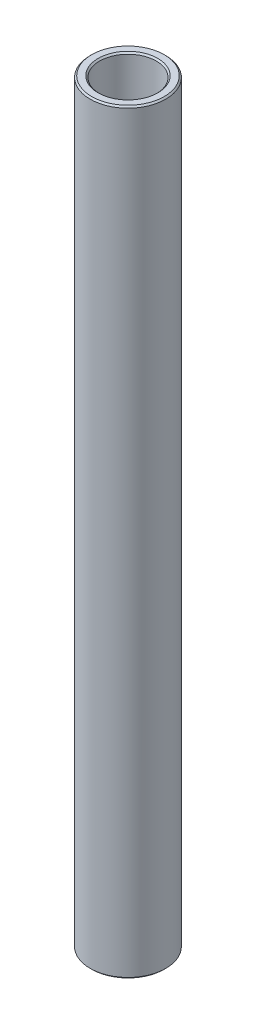
ISO-10303-21;
HEADER;
FILE_DESCRIPTION(('STEP AP214'),'2;1');
FILE_NAME('part.step','',(''),(''),'','','');
FILE_SCHEMA(('AUTOMOTIVE_DESIGN { 1 0 10303 214 1 1 1 1 }'));
ENDSEC;
DATA;
#1=APPLICATION_CONTEXT('core data for automotive mechanical design processes');
#2=APPLICATION_PROTOCOL_DEFINITION('international standard','automotive_design',2000,#1);
#3=PRODUCT_CONTEXT('',#1,'mechanical');
#4=PRODUCT('Part','Part','',(#3));
#5=PRODUCT_RELATED_PRODUCT_CATEGORY('part','',(#4));
#6=PRODUCT_DEFINITION_FORMATION('','',#4);
#7=PRODUCT_DEFINITION_CONTEXT('part definition',#1,'design');
#8=PRODUCT_DEFINITION('design','',#6,#7);
#9=PRODUCT_DEFINITION_SHAPE('','',#8);
#10=(LENGTH_UNIT() NAMED_UNIT(*) SI_UNIT(.MILLI.,.METRE.));
#11=(NAMED_UNIT(*) PLANE_ANGLE_UNIT() SI_UNIT($,.RADIAN.));
#12=(NAMED_UNIT(*) SI_UNIT($,.STERADIAN.) SOLID_ANGLE_UNIT());
#13=UNCERTAINTY_MEASURE_WITH_UNIT(LENGTH_MEASURE(1.E-05),#10,'distance_accuracy_value','');
#14=(GEOMETRIC_REPRESENTATION_CONTEXT(3) GLOBAL_UNCERTAINTY_ASSIGNED_CONTEXT((#13)) GLOBAL_UNIT_ASSIGNED_CONTEXT((#10,
#11,#12)) REPRESENTATION_CONTEXT('',''));
#15=CARTESIAN_POINT('',(0.,0.,0.));
#16=DIRECTION('',(0.,0.,1.));
#17=DIRECTION('',(1.,0.,0.));
#18=AXIS2_PLACEMENT_3D('',#15,#16,#17);
#19=CARTESIAN_POINT('',(0.,11.60859375,0.));
#20=DIRECTION('',(0.,1.,0.));
#21=DIRECTION('',(-1.,0.,0.));
#22=AXIS2_PLACEMENT_3D('',#19,#20,#21);
#23=CYLINDRICAL_SURFACE('',#22,4.76250000000001);
#24=CARTESIAN_POINT('',(0.,-63.246,0.));
#25=DIRECTION('',(0.,1.,0.));
#26=DIRECTION('',(-1.,0.,0.));
#27=AXIS2_PLACEMENT_3D('',#24,#25,#26);
#28=CIRCLE('',#27,4.76250000000001);
#29=CARTESIAN_POINT('',(-4.76250000000002,-63.246,0.));
#30=VERTEX_POINT('',#29);
#31=EDGE_CURVE('E50',#30,#30,#28,.F.);
#32=ORIENTED_EDGE('',*,*,#31,.T.);
#33=EDGE_LOOP('',(#32));
#34=FACE_BOUND('',#33,.T.);
#35=CARTESIAN_POINT('',(0.,63.246,0.));
#36=DIRECTION('',(0.,-1.,0.));
#37=DIRECTION('',(1.,0.,0.));
#38=AXIS2_PLACEMENT_3D('',#35,#36,#37);
#39=CIRCLE('',#38,4.76250000000001);
#40=CARTESIAN_POINT('',(4.76250000000002,63.246,0.));
#41=VERTEX_POINT('',#40);
#42=EDGE_CURVE('E53',#41,#41,#39,.F.);
#43=ORIENTED_EDGE('',*,*,#42,.T.);
#44=EDGE_LOOP('',(#43));
#45=FACE_BOUND('',#44,.T.);
#46=ADVANCED_FACE('F30',(#34,#45),#23,.F.);
#47=CARTESIAN_POINT('',(4.76250000000001,63.5,0.));
#48=DIRECTION('',(0.,-1.,0.));
#49=DIRECTION('',(1.,0.,0.));
#50=AXIS2_PLACEMENT_3D('',#47,#48,#49);
#51=PLANE('',#50);
#52=CARTESIAN_POINT('',(0.,63.5,0.));
#53=DIRECTION('',(0.,-1.,0.));
#54=DIRECTION('',(1.,0.,0.));
#55=AXIS2_PLACEMENT_3D('',#52,#53,#54);
#56=CIRCLE('',#55,6.09599999999997);
#57=CARTESIAN_POINT('',(6.09599999999998,63.5,0.));
#58=VERTEX_POINT('',#57);
#59=EDGE_CURVE('E10',#58,#58,#56,.F.);
#60=ORIENTED_EDGE('',*,*,#59,.T.);
#61=EDGE_LOOP('',(#60));
#62=FACE_BOUND('',#61,.T.);
#63=CARTESIAN_POINT('',(0.,63.5,0.));
#64=DIRECTION('',(0.,-1.,0.));
#65=DIRECTION('',(1.,0.,0.));
#66=AXIS2_PLACEMENT_3D('',#63,#64,#65);
#67=CIRCLE('',#66,5.01650000000003);
#68=CARTESIAN_POINT('',(5.01650000000004,63.5,0.));
#69=VERTEX_POINT('',#68);
#70=EDGE_CURVE('E37',#69,#69,#67,.T.);
#71=ORIENTED_EDGE('',*,*,#70,.T.);
#72=EDGE_LOOP('',(#71));
#73=FACE_BOUND('',#72,.T.);
#74=ADVANCED_FACE('F76',(#62,#73),#51,.F.);
#75=CARTESIAN_POINT('',(0.,11.60859375,0.));
#76=DIRECTION('',(0.,1.,0.));
#77=DIRECTION('',(-1.,0.,0.));
#78=AXIS2_PLACEMENT_3D('',#75,#76,#77);
#79=CYLINDRICAL_SURFACE('',#78,6.35);
#80=CARTESIAN_POINT('',(0.,-63.246,0.));
#81=DIRECTION('',(0.,1.,0.));
#82=DIRECTION('',(-1.,0.,0.));
#83=AXIS2_PLACEMENT_3D('',#80,#81,#82);
#84=CIRCLE('',#83,6.35);
#85=CARTESIAN_POINT('',(-6.35,-63.246,0.));
#86=VERTEX_POINT('',#85);
#87=EDGE_CURVE('E41',#86,#86,#84,.T.);
#88=ORIENTED_EDGE('',*,*,#87,.T.);
#89=EDGE_LOOP('',(#88));
#90=FACE_BOUND('',#89,.T.);
#91=CARTESIAN_POINT('',(0.,63.246,0.));
#92=DIRECTION('',(0.,-1.,0.));
#93=DIRECTION('',(1.,0.,0.));
#94=AXIS2_PLACEMENT_3D('',#91,#92,#93);
#95=CIRCLE('',#94,6.35);
#96=CARTESIAN_POINT('',(6.35000000000001,63.246,0.));
#97=VERTEX_POINT('',#96);
#98=EDGE_CURVE('E45',#97,#97,#95,.T.);
#99=ORIENTED_EDGE('',*,*,#98,.T.);
#100=EDGE_LOOP('',(#99));
#101=FACE_BOUND('',#100,.T.);
#102=ADVANCED_FACE('F73',(#90,#101),#79,.T.);
#103=CARTESIAN_POINT('',(6.35000000000001,-63.5,0.));
#104=DIRECTION('',(0.,1.,0.));
#105=DIRECTION('',(-1.,0.,0.));
#106=AXIS2_PLACEMENT_3D('',#103,#104,#105);
#107=PLANE('',#106);
#108=CARTESIAN_POINT('',(0.,-63.5,0.));
#109=DIRECTION('',(0.,1.,0.));
#110=DIRECTION('',(-1.,0.,0.));
#111=AXIS2_PLACEMENT_3D('',#108,#109,#110);
#112=CIRCLE('',#111,5.01650000000002);
#113=CARTESIAN_POINT('',(-5.01650000000003,-63.5,0.));
#114=VERTEX_POINT('',#113);
#115=EDGE_CURVE('E56',#114,#114,#112,.T.);
#116=ORIENTED_EDGE('',*,*,#115,.T.);
#117=EDGE_LOOP('',(#116));
#118=FACE_BOUND('',#117,.T.);
#119=CARTESIAN_POINT('',(0.,-63.5,0.));
#120=DIRECTION('',(0.,1.,0.));
#121=DIRECTION('',(-1.,0.,0.));
#122=AXIS2_PLACEMENT_3D('',#119,#120,#121);
#123=CIRCLE('',#122,6.09599999999998);
#124=CARTESIAN_POINT('',(-6.09599999999998,-63.5,0.));
#125=VERTEX_POINT('',#124);
#126=EDGE_CURVE('E59',#125,#125,#123,.F.);
#127=ORIENTED_EDGE('',*,*,#126,.T.);
#128=EDGE_LOOP('',(#127));
#129=FACE_BOUND('',#128,.T.);
#130=ADVANCED_FACE('F63',(#118,#129),#107,.F.);
#131=CARTESIAN_POINT('',(0.,-63.5,0.));
#132=DIRECTION('',(0.,-1.,0.));
#133=DIRECTION('',(1.,0.,0.));
#134=AXIS2_PLACEMENT_3D('',#131,#132,#133);
#135=CONICAL_SURFACE('',#134,5.01650000000002,0.785398163397457);
#136=ORIENTED_EDGE('',*,*,#31,.F.);
#137=EDGE_LOOP('',(#136));
#138=FACE_BOUND('',#137,.T.);
#139=ORIENTED_EDGE('',*,*,#115,.F.);
#140=EDGE_LOOP('',(#139));
#141=FACE_BOUND('',#140,.T.);
#142=ADVANCED_FACE('F69',(#138,#141),#135,.F.);
#143=CARTESIAN_POINT('',(0.,-63.246,0.));
#144=DIRECTION('',(0.,1.,0.));
#145=DIRECTION('',(-1.,0.,0.));
#146=AXIS2_PLACEMENT_3D('',#143,#144,#145);
#147=CONICAL_SURFACE('',#146,6.35,0.785398163397431);
#148=ORIENTED_EDGE('',*,*,#126,.F.);
#149=EDGE_LOOP('',(#148));
#150=FACE_BOUND('',#149,.T.);
#151=ORIENTED_EDGE('',*,*,#87,.F.);
#152=EDGE_LOOP('',(#151));
#153=FACE_BOUND('',#152,.T.);
#154=ADVANCED_FACE('F65',(#150,#153),#147,.T.);
#155=CARTESIAN_POINT('',(0.,63.5,0.));
#156=DIRECTION('',(0.,-1.,0.));
#157=DIRECTION('',(1.,0.,0.));
#158=AXIS2_PLACEMENT_3D('',#155,#156,#157);
#159=CONICAL_SURFACE('',#158,6.09599999999998,0.785398163397458);
#160=ORIENTED_EDGE('',*,*,#98,.F.);
#161=EDGE_LOOP('',(#160));
#162=FACE_BOUND('',#161,.T.);
#163=ORIENTED_EDGE('',*,*,#59,.F.);
#164=EDGE_LOOP('',(#163));
#165=FACE_BOUND('',#164,.T.);
#166=ADVANCED_FACE('F68',(#162,#165),#159,.T.);
#167=CARTESIAN_POINT('',(0.,63.246,0.));
#168=DIRECTION('',(0.,1.,0.));
#169=DIRECTION('',(-1.,0.,0.));
#170=AXIS2_PLACEMENT_3D('',#167,#168,#169);
#171=CONICAL_SURFACE('',#170,4.76250000000001,0.785398163397484);
#172=ORIENTED_EDGE('',*,*,#70,.F.);
#173=EDGE_LOOP('',(#172));
#174=FACE_BOUND('',#173,.T.);
#175=ORIENTED_EDGE('',*,*,#42,.F.);
#176=EDGE_LOOP('',(#175));
#177=FACE_BOUND('',#176,.T.);
#178=ADVANCED_FACE('F32',(#174,#177),#171,.F.);
#179=CLOSED_SHELL('',(#46,#74,#102,#130,#142,#154,#166,#178));
#180=MANIFOLD_SOLID_BREP('B2',#179);
#181=ADVANCED_BREP_SHAPE_REPRESENTATION('',(#18,#180),#14);
#182=SHAPE_DEFINITION_REPRESENTATION(#9,#181);
ENDSEC;
END-ISO-10303-21;
